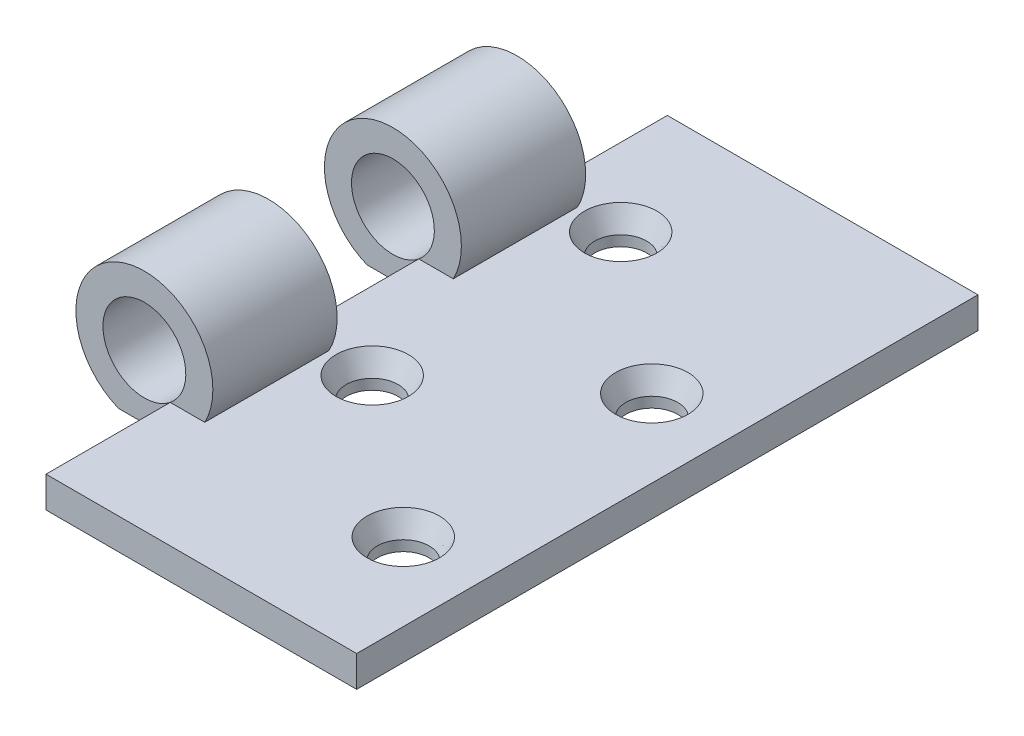
ISO-10303-21;
HEADER;
FILE_DESCRIPTION(('STEP AP214'),'2;1');
FILE_NAME('part.step','',(''),(''),'','','');
FILE_SCHEMA(('AUTOMOTIVE_DESIGN { 1 0 10303 214 1 1 1 1 }'));
ENDSEC;
DATA;
#1=APPLICATION_CONTEXT('core data for automotive mechanical design processes');
#2=APPLICATION_PROTOCOL_DEFINITION('international standard','automotive_design',2000,#1);
#3=PRODUCT_CONTEXT('',#1,'mechanical');
#4=PRODUCT('Part','Part','',(#3));
#5=PRODUCT_RELATED_PRODUCT_CATEGORY('part','',(#4));
#6=PRODUCT_DEFINITION_FORMATION('','',#4);
#7=PRODUCT_DEFINITION_CONTEXT('part definition',#1,'design');
#8=PRODUCT_DEFINITION('design','',#6,#7);
#9=PRODUCT_DEFINITION_SHAPE('','',#8);
#10=(LENGTH_UNIT() NAMED_UNIT(*) SI_UNIT(.MILLI.,.METRE.));
#11=(NAMED_UNIT(*) PLANE_ANGLE_UNIT() SI_UNIT($,.RADIAN.));
#12=(NAMED_UNIT(*) SI_UNIT($,.STERADIAN.) SOLID_ANGLE_UNIT());
#13=UNCERTAINTY_MEASURE_WITH_UNIT(LENGTH_MEASURE(1.E-05),#10,'distance_accuracy_value','');
#14=(GEOMETRIC_REPRESENTATION_CONTEXT(3) GLOBAL_UNCERTAINTY_ASSIGNED_CONTEXT((#13)) GLOBAL_UNIT_ASSIGNED_CONTEXT((#10,
#11,#12)) REPRESENTATION_CONTEXT('',''));
#15=CARTESIAN_POINT('',(0.,0.,0.));
#16=DIRECTION('',(0.,0.,1.));
#17=DIRECTION('',(1.,0.,0.));
#18=AXIS2_PLACEMENT_3D('',#15,#16,#17);
#19=CARTESIAN_POINT('',(-15.,3.,30.));
#20=DIRECTION('',(1.,0.,0.));
#21=DIRECTION('',(0.,0.,-1.));
#22=AXIS2_PLACEMENT_3D('',#19,#20,#21);
#23=PLANE('',#22);
#24=DIRECTION('',(0.,1.,0.));
#25=VECTOR('',#24,1.);
#26=CARTESIAN_POINT('',(-15.,3.,-6.));
#27=LINE('',#26,#25);
#28=CARTESIAN_POINT('',(-15.,0.,-6.));
#29=VERTEX_POINT('',#28);
#30=CARTESIAN_POINT('',(-15.,3.,-6.));
#31=VERTEX_POINT('',#30);
#32=EDGE_CURVE('E150',#29,#31,#27,.T.);
#33=ORIENTED_EDGE('',*,*,#32,.F.);
#34=DIRECTION('',(0.,0.,1.));
#35=VECTOR('',#34,1.);
#36=CARTESIAN_POINT('',(-15.,0.,30.));
#37=LINE('',#36,#35);
#38=CARTESIAN_POINT('',(-15.,0.,6.));
#39=VERTEX_POINT('',#38);
#40=EDGE_CURVE('E131',#29,#39,#37,.T.);
#41=ORIENTED_EDGE('',*,*,#40,.T.);
#42=DIRECTION('',(0.,-1.,0.));
#43=VECTOR('',#42,1.);
#44=CARTESIAN_POINT('',(-15.,3.,6.));
#45=LINE('',#44,#43);
#46=CARTESIAN_POINT('',(-15.,3.,6.));
#47=VERTEX_POINT('',#46);
#48=EDGE_CURVE('E202',#47,#39,#45,.T.);
#49=ORIENTED_EDGE('',*,*,#48,.F.);
#50=DIRECTION('',(0.,0.,1.));
#51=VECTOR('',#50,1.);
#52=CARTESIAN_POINT('',(-15.,3.,30.));
#53=LINE('',#52,#51);
#54=EDGE_CURVE('E151',#31,#47,#53,.T.);
#55=ORIENTED_EDGE('',*,*,#54,.F.);
#56=EDGE_LOOP('',(#33,#41,#49,#55));
#57=FACE_BOUND('',#56,.T.);
#58=ADVANCED_FACE('F42',(#57),#23,.F.);
#59=CARTESIAN_POINT('',(0.,3.,0.));
#60=DIRECTION('',(0.,1.,0.));
#61=DIRECTION('',(0.,0.,1.));
#62=AXIS2_PLACEMENT_3D('',#59,#60,#61);
#63=PLANE('',#62);
#64=CARTESIAN_POINT('',(-7.5,3.,6.00000000000001));
#65=DIRECTION('',(0.,1.,0.));
#66=DIRECTION('',(0.,0.,1.));
#67=AXIS2_PLACEMENT_3D('',#64,#65,#66);
#68=CIRCLE('',#67,3.5);
#69=CARTESIAN_POINT('',(-7.5,3.,9.5));
#70=VERTEX_POINT('',#69);
#71=EDGE_CURVE('E246',#70,#70,#68,.F.);
#72=ORIENTED_EDGE('',*,*,#71,.T.);
#73=EDGE_LOOP('',(#72));
#74=FACE_BOUND('',#73,.T.);
#75=CARTESIAN_POINT('',(-7.5,3.,-18.));
#76=DIRECTION('',(0.,1.,0.));
#77=DIRECTION('',(0.,0.,1.));
#78=AXIS2_PLACEMENT_3D('',#75,#76,#77);
#79=CIRCLE('',#78,3.50000000000001);
#80=CARTESIAN_POINT('',(-7.5,3.,-14.5));
#81=VERTEX_POINT('',#80);
#82=EDGE_CURVE('E243',#81,#81,#79,.F.);
#83=ORIENTED_EDGE('',*,*,#82,.T.);
#84=EDGE_LOOP('',(#83));
#85=FACE_BOUND('',#84,.T.);
#86=CARTESIAN_POINT('',(7.5,3.,-6.));
#87=DIRECTION('',(0.,1.,0.));
#88=DIRECTION('',(0.,0.,1.));
#89=AXIS2_PLACEMENT_3D('',#86,#87,#88);
#90=CIRCLE('',#89,3.50000000000001);
#91=CARTESIAN_POINT('',(7.5,3.,-2.49999999999998));
#92=VERTEX_POINT('',#91);
#93=EDGE_CURVE('E240',#92,#92,#90,.F.);
#94=ORIENTED_EDGE('',*,*,#93,.T.);
#95=EDGE_LOOP('',(#94));
#96=FACE_BOUND('',#95,.T.);
#97=CARTESIAN_POINT('',(7.5,3.,18.));
#98=DIRECTION('',(0.,1.,0.));
#99=DIRECTION('',(0.,0.,1.));
#100=AXIS2_PLACEMENT_3D('',#97,#98,#99);
#101=CIRCLE('',#100,3.50000000000001);
#102=CARTESIAN_POINT('',(7.5,3.,21.5));
#103=VERTEX_POINT('',#102);
#104=EDGE_CURVE('E237',#103,#103,#101,.F.);
#105=ORIENTED_EDGE('',*,*,#104,.T.);
#106=EDGE_LOOP('',(#105));
#107=FACE_BOUND('',#106,.T.);
#108=DIRECTION('',(0.,0.,-1.));
#109=VECTOR('',#108,1.);
#110=CARTESIAN_POINT('',(-11.6703350014606,3.,-6.));
#111=LINE('',#110,#109);
#112=CARTESIAN_POINT('',(-11.6703350014606,3.,-18.));
#113=VERTEX_POINT('',#112);
#114=CARTESIAN_POINT('',(-11.6703350014606,3.,-6.));
#115=VERTEX_POINT('',#114);
#116=EDGE_CURVE('E58',#113,#115,#111,.F.);
#117=ORIENTED_EDGE('',*,*,#116,.T.);
#118=DIRECTION('',(-1.,0.,0.));
#119=VECTOR('',#118,1.);
#120=CARTESIAN_POINT('',(0.,3.,-6.));
#121=LINE('',#120,#119);
#122=EDGE_CURVE('E156',#115,#31,#121,.T.);
#123=ORIENTED_EDGE('',*,*,#122,.T.);
#124=ORIENTED_EDGE('',*,*,#54,.T.);
#125=DIRECTION('',(1.,0.,0.));
#126=VECTOR('',#125,1.);
#127=CARTESIAN_POINT('',(0.,3.,6.));
#128=LINE('',#127,#126);
#129=CARTESIAN_POINT('',(-11.6703350014606,3.,6.));
#130=VERTEX_POINT('',#129);
#131=EDGE_CURVE('E200',#47,#130,#128,.T.);
#132=ORIENTED_EDGE('',*,*,#131,.T.);
#133=DIRECTION('',(0.,0.,1.));
#134=VECTOR('',#133,1.);
#135=CARTESIAN_POINT('',(-11.6703350014606,3.,6.));
#136=LINE('',#135,#134);
#137=CARTESIAN_POINT('',(-11.6703350014606,3.,18.));
#138=VERTEX_POINT('',#137);
#139=EDGE_CURVE('E204',#138,#130,#136,.F.);
#140=ORIENTED_EDGE('',*,*,#139,.F.);
#141=DIRECTION('',(1.,0.,0.));
#142=VECTOR('',#141,1.);
#143=CARTESIAN_POINT('',(0.,3.,18.));
#144=LINE('',#143,#142);
#145=CARTESIAN_POINT('',(-15.,3.,18.));
#146=VERTEX_POINT('',#145);
#147=EDGE_CURVE('E194',#146,#138,#144,.T.);
#148=ORIENTED_EDGE('',*,*,#147,.F.);
#149=CARTESIAN_POINT('',(-15.,3.,30.));
#150=VERTEX_POINT('',#149);
#151=EDGE_CURVE('E210',#146,#150,#53,.T.);
#152=ORIENTED_EDGE('',*,*,#151,.T.);
#153=DIRECTION('',(1.,0.,0.));
#154=VECTOR('',#153,1.);
#155=CARTESIAN_POINT('',(15.,3.,30.));
#156=LINE('',#155,#154);
#157=CARTESIAN_POINT('',(15.,3.,30.));
#158=VERTEX_POINT('',#157);
#159=EDGE_CURVE('E209',#150,#158,#156,.T.);
#160=ORIENTED_EDGE('',*,*,#159,.T.);
#161=DIRECTION('',(0.,0.,-1.));
#162=VECTOR('',#161,1.);
#163=CARTESIAN_POINT('',(15.,3.,30.));
#164=LINE('',#163,#162);
#165=CARTESIAN_POINT('',(15.,3.,-30.));
#166=VERTEX_POINT('',#165);
#167=EDGE_CURVE('E212',#158,#166,#164,.T.);
#168=ORIENTED_EDGE('',*,*,#167,.T.);
#169=DIRECTION('',(-1.,0.,0.));
#170=VECTOR('',#169,1.);
#171=CARTESIAN_POINT('',(15.,3.,-30.));
#172=LINE('',#171,#170);
#173=CARTESIAN_POINT('',(-15.,3.,-30.));
#174=VERTEX_POINT('',#173);
#175=EDGE_CURVE('E214',#166,#174,#172,.T.);
#176=ORIENTED_EDGE('',*,*,#175,.T.);
#177=CARTESIAN_POINT('',(-15.,3.,-18.));
#178=VERTEX_POINT('',#177);
#179=EDGE_CURVE('E207',#174,#178,#53,.T.);
#180=ORIENTED_EDGE('',*,*,#179,.T.);
#181=DIRECTION('',(-1.,0.,0.));
#182=VECTOR('',#181,1.);
#183=CARTESIAN_POINT('',(0.,3.,-18.));
#184=LINE('',#183,#182);
#185=EDGE_CURVE('E63',#113,#178,#184,.T.);
#186=ORIENTED_EDGE('',*,*,#185,.F.);
#187=EDGE_LOOP('',(#117,#123,#124,#132,#140,#148,#152,#160,#168,#176,#180,#186));
#188=FACE_BOUND('',#187,.T.);
#189=ADVANCED_FACE('F272',(#74,#85,#96,#107,#188),#63,.T.);
#190=CARTESIAN_POINT('',(-15.,0.,-30.));
#191=VERTEX_POINT('',#190);
#192=CARTESIAN_POINT('',(-15.,0.,-18.));
#193=VERTEX_POINT('',#192);
#194=EDGE_CURVE('E145',#191,#193,#37,.T.);
#195=ORIENTED_EDGE('',*,*,#194,.T.);
#196=DIRECTION('',(0.,1.,0.));
#197=VECTOR('',#196,1.);
#198=CARTESIAN_POINT('',(-15.,3.,-18.));
#199=LINE('',#198,#197);
#200=EDGE_CURVE('E175',#193,#178,#199,.T.);
#201=ORIENTED_EDGE('',*,*,#200,.T.);
#202=ORIENTED_EDGE('',*,*,#179,.F.);
#203=DIRECTION('',(0.,-1.,0.));
#204=VECTOR('',#203,1.);
#205=CARTESIAN_POINT('',(-15.,3.,-30.));
#206=LINE('',#205,#204);
#207=EDGE_CURVE('E215',#174,#191,#206,.T.);
#208=ORIENTED_EDGE('',*,*,#207,.T.);
#209=EDGE_LOOP('',(#195,#201,#202,#208));
#210=FACE_BOUND('',#209,.T.);
#211=ADVANCED_FACE('F274',(#210),#23,.F.);
#212=ORIENTED_EDGE('',*,*,#151,.F.);
#213=DIRECTION('',(0.,-1.,0.));
#214=VECTOR('',#213,1.);
#215=CARTESIAN_POINT('',(-15.,3.,18.));
#216=LINE('',#215,#214);
#217=CARTESIAN_POINT('',(-15.,0.,18.));
#218=VERTEX_POINT('',#217);
#219=EDGE_CURVE('E197',#146,#218,#216,.T.);
#220=ORIENTED_EDGE('',*,*,#219,.T.);
#221=CARTESIAN_POINT('',(-15.,0.,30.));
#222=VERTEX_POINT('',#221);
#223=EDGE_CURVE('E146',#218,#222,#37,.T.);
#224=ORIENTED_EDGE('',*,*,#223,.T.);
#225=DIRECTION('',(0.,-1.,0.));
#226=VECTOR('',#225,1.);
#227=CARTESIAN_POINT('',(-15.,3.,30.));
#228=LINE('',#227,#226);
#229=EDGE_CURVE('E231',#150,#222,#228,.T.);
#230=ORIENTED_EDGE('',*,*,#229,.F.);
#231=EDGE_LOOP('',(#212,#220,#224,#230));
#232=FACE_BOUND('',#231,.T.);
#233=ADVANCED_FACE('F275',(#232),#23,.F.);
#234=CARTESIAN_POINT('',(15.,3.,30.));
#235=DIRECTION('',(0.,0.,-1.));
#236=DIRECTION('',(-1.,0.,0.));
#237=AXIS2_PLACEMENT_3D('',#234,#235,#236);
#238=PLANE('',#237);
#239=DIRECTION('',(1.,0.,0.));
#240=VECTOR('',#239,1.);
#241=CARTESIAN_POINT('',(15.,0.,30.));
#242=LINE('',#241,#240);
#243=CARTESIAN_POINT('',(15.,0.,30.));
#244=VERTEX_POINT('',#243);
#245=EDGE_CURVE('E217',#222,#244,#242,.T.);
#246=ORIENTED_EDGE('',*,*,#245,.T.);
#247=DIRECTION('',(0.,-1.,0.));
#248=VECTOR('',#247,1.);
#249=CARTESIAN_POINT('',(15.,3.,30.));
#250=LINE('',#249,#248);
#251=EDGE_CURVE('E228',#158,#244,#250,.T.);
#252=ORIENTED_EDGE('',*,*,#251,.F.);
#253=ORIENTED_EDGE('',*,*,#159,.F.);
#254=ORIENTED_EDGE('',*,*,#229,.T.);
#255=EDGE_LOOP('',(#246,#252,#253,#254));
#256=FACE_BOUND('',#255,.T.);
#257=ADVANCED_FACE('F286',(#256),#238,.F.);
#258=CARTESIAN_POINT('',(15.,3.,30.));
#259=DIRECTION('',(-1.,0.,0.));
#260=DIRECTION('',(0.,0.,1.));
#261=AXIS2_PLACEMENT_3D('',#258,#259,#260);
#262=PLANE('',#261);
#263=DIRECTION('',(0.,0.,-1.));
#264=VECTOR('',#263,1.);
#265=CARTESIAN_POINT('',(15.,0.,30.));
#266=LINE('',#265,#264);
#267=CARTESIAN_POINT('',(15.,0.,-30.));
#268=VERTEX_POINT('',#267);
#269=EDGE_CURVE('E219',#244,#268,#266,.T.);
#270=ORIENTED_EDGE('',*,*,#269,.T.);
#271=DIRECTION('',(0.,-1.,0.));
#272=VECTOR('',#271,1.);
#273=CARTESIAN_POINT('',(15.,3.,-30.));
#274=LINE('',#273,#272);
#275=EDGE_CURVE('E225',#166,#268,#274,.T.);
#276=ORIENTED_EDGE('',*,*,#275,.F.);
#277=ORIENTED_EDGE('',*,*,#167,.F.);
#278=ORIENTED_EDGE('',*,*,#251,.T.);
#279=EDGE_LOOP('',(#270,#276,#277,#278));
#280=FACE_BOUND('',#279,.T.);
#281=ADVANCED_FACE('F291',(#280),#262,.F.);
#282=CARTESIAN_POINT('',(15.,3.,-30.));
#283=DIRECTION('',(0.,0.,1.));
#284=DIRECTION('',(1.,0.,0.));
#285=AXIS2_PLACEMENT_3D('',#282,#283,#284);
#286=PLANE('',#285);
#287=DIRECTION('',(-1.,0.,0.));
#288=VECTOR('',#287,1.);
#289=CARTESIAN_POINT('',(15.,0.,-30.));
#290=LINE('',#289,#288);
#291=EDGE_CURVE('E221',#268,#191,#290,.T.);
#292=ORIENTED_EDGE('',*,*,#291,.T.);
#293=ORIENTED_EDGE('',*,*,#207,.F.);
#294=ORIENTED_EDGE('',*,*,#175,.F.);
#295=ORIENTED_EDGE('',*,*,#275,.T.);
#296=EDGE_LOOP('',(#292,#293,#294,#295));
#297=FACE_BOUND('',#296,.T.);
#298=ADVANCED_FACE('F328',(#297),#286,.F.);
#299=CARTESIAN_POINT('',(0.,0.,0.));
#300=DIRECTION('',(0.,1.,0.));
#301=DIRECTION('',(0.,0.,1.));
#302=AXIS2_PLACEMENT_3D('',#299,#300,#301);
#303=PLANE('',#302);
#304=CARTESIAN_POINT('',(-7.5,0.,-18.));
#305=DIRECTION('',(0.,1.,0.));
#306=DIRECTION('',(0.,0.,1.));
#307=AXIS2_PLACEMENT_3D('',#304,#305,#306);
#308=CIRCLE('',#307,2.5);
#309=CARTESIAN_POINT('',(-7.5,0.,-15.5));
#310=VERTEX_POINT('',#309);
#311=EDGE_CURVE('E360',#310,#310,#308,.T.);
#312=ORIENTED_EDGE('',*,*,#311,.T.);
#313=EDGE_LOOP('',(#312));
#314=FACE_BOUND('',#313,.T.);
#315=CARTESIAN_POINT('',(-7.5,0.,6.00000000000001));
#316=DIRECTION('',(0.,1.,0.));
#317=DIRECTION('',(0.,0.,1.));
#318=AXIS2_PLACEMENT_3D('',#315,#316,#317);
#319=CIRCLE('',#318,2.5);
#320=CARTESIAN_POINT('',(-7.5,0.,8.50000000000001));
#321=VERTEX_POINT('',#320);
#322=EDGE_CURVE('E363',#321,#321,#319,.T.);
#323=ORIENTED_EDGE('',*,*,#322,.T.);
#324=EDGE_LOOP('',(#323));
#325=FACE_BOUND('',#324,.T.);
#326=CARTESIAN_POINT('',(7.5,0.,18.));
#327=DIRECTION('',(0.,1.,0.));
#328=DIRECTION('',(0.,0.,1.));
#329=AXIS2_PLACEMENT_3D('',#326,#327,#328);
#330=CIRCLE('',#329,2.5);
#331=CARTESIAN_POINT('',(7.5,0.,20.5));
#332=VERTEX_POINT('',#331);
#333=EDGE_CURVE('E357',#332,#332,#330,.T.);
#334=ORIENTED_EDGE('',*,*,#333,.T.);
#335=EDGE_LOOP('',(#334));
#336=FACE_BOUND('',#335,.T.);
#337=CARTESIAN_POINT('',(7.5,0.,-6.));
#338=DIRECTION('',(0.,1.,0.));
#339=DIRECTION('',(0.,0.,1.));
#340=AXIS2_PLACEMENT_3D('',#337,#338,#339);
#341=CIRCLE('',#340,2.5);
#342=CARTESIAN_POINT('',(7.5,0.,-3.5));
#343=VERTEX_POINT('',#342);
#344=EDGE_CURVE('E354',#343,#343,#341,.T.);
#345=ORIENTED_EDGE('',*,*,#344,.T.);
#346=EDGE_LOOP('',(#345));
#347=FACE_BOUND('',#346,.T.);
#348=ORIENTED_EDGE('',*,*,#194,.F.);
#349=ORIENTED_EDGE('',*,*,#291,.F.);
#350=ORIENTED_EDGE('',*,*,#269,.F.);
#351=ORIENTED_EDGE('',*,*,#245,.F.);
#352=ORIENTED_EDGE('',*,*,#223,.F.);
#353=DIRECTION('',(1.,0.,0.));
#354=VECTOR('',#353,1.);
#355=CARTESIAN_POINT('',(-15.,0.,18.));
#356=LINE('',#355,#354);
#357=CARTESIAN_POINT('',(-20.,0.,18.));
#358=VERTEX_POINT('',#357);
#359=EDGE_CURVE('E186',#358,#218,#356,.T.);
#360=ORIENTED_EDGE('',*,*,#359,.F.);
#361=DIRECTION('',(0.,0.,1.));
#362=VECTOR('',#361,1.);
#363=CARTESIAN_POINT('',(-20.,0.,6.));
#364=LINE('',#363,#362);
#365=CARTESIAN_POINT('',(-20.,0.,6.));
#366=VERTEX_POINT('',#365);
#367=EDGE_CURVE('E188',#366,#358,#364,.T.);
#368=ORIENTED_EDGE('',*,*,#367,.F.);
#369=DIRECTION('',(1.,0.,0.));
#370=VECTOR('',#369,1.);
#371=CARTESIAN_POINT('',(-15.,0.,6.));
#372=LINE('',#371,#370);
#373=EDGE_CURVE('E141',#366,#39,#372,.T.);
#374=ORIENTED_EDGE('',*,*,#373,.T.);
#375=ORIENTED_EDGE('',*,*,#40,.F.);
#376=DIRECTION('',(1.,0.,0.));
#377=VECTOR('',#376,1.);
#378=CARTESIAN_POINT('',(-15.,0.,-6.));
#379=LINE('',#378,#377);
#380=CARTESIAN_POINT('',(-20.,0.,-6.));
#381=VERTEX_POINT('',#380);
#382=EDGE_CURVE('E137',#381,#29,#379,.T.);
#383=ORIENTED_EDGE('',*,*,#382,.F.);
#384=DIRECTION('',(0.,0.,-1.));
#385=VECTOR('',#384,1.);
#386=CARTESIAN_POINT('',(-20.,0.,-6.));
#387=LINE('',#386,#385);
#388=CARTESIAN_POINT('',(-20.,0.,-18.));
#389=VERTEX_POINT('',#388);
#390=EDGE_CURVE('E161',#381,#389,#387,.T.);
#391=ORIENTED_EDGE('',*,*,#390,.T.);
#392=DIRECTION('',(1.,0.,0.));
#393=VECTOR('',#392,1.);
#394=CARTESIAN_POINT('',(-15.,0.,-18.));
#395=LINE('',#394,#393);
#396=EDGE_CURVE('E164',#389,#193,#395,.T.);
#397=ORIENTED_EDGE('',*,*,#396,.T.);
#398=EDGE_LOOP('',(#348,#349,#350,#351,#352,#360,#368,#374,#375,#383,#391,#397));
#399=FACE_BOUND('',#398,.T.);
#400=ADVANCED_FACE('F134',(#314,#325,#336,#347,#399),#303,.F.);
#401=CARTESIAN_POINT('',(-17.5,6.1224989991992,6.));
#402=DIRECTION('',(0.,0.,1.));
#403=DIRECTION('',(1.,0.,0.));
#404=AXIS2_PLACEMENT_3D('',#401,#402,#403);
#405=PLANE('',#404);
#406=CARTESIAN_POINT('',(-17.5,6.1224989991992,6.));
#407=DIRECTION('',(0.,0.,1.));
#408=DIRECTION('',(1.,0.,0.));
#409=AXIS2_PLACEMENT_3D('',#406,#407,#408);
#410=CIRCLE('',#409,4.);
#411=EDGE_CURVE('E178',#47,#47,#410,.T.);
#412=ORIENTED_EDGE('',*,*,#411,.T.);
#413=ORIENTED_EDGE('',*,*,#48,.T.);
#414=ORIENTED_EDGE('',*,*,#373,.F.);
#415=CARTESIAN_POINT('',(-17.5,6.1224989991992,6.));
#416=DIRECTION('',(0.,0.,1.));
#417=DIRECTION('',(1.,0.,0.));
#418=AXIS2_PLACEMENT_3D('',#415,#416,#417);
#419=CIRCLE('',#418,6.61324383303649);
#420=EDGE_CURVE('E184',#130,#366,#419,.T.);
#421=ORIENTED_EDGE('',*,*,#420,.F.);
#422=ORIENTED_EDGE('',*,*,#131,.F.);
#423=EDGE_LOOP('',(#412,#413,#414,#421,#422));
#424=FACE_BOUND('',#423,.T.);
#425=ADVANCED_FACE('F320',(#424),#405,.F.);
#426=CARTESIAN_POINT('',(-17.5,6.1224989991992,18.));
#427=DIRECTION('',(0.,0.,1.));
#428=DIRECTION('',(1.,0.,0.));
#429=AXIS2_PLACEMENT_3D('',#426,#427,#428);
#430=PLANE('',#429);
#431=ORIENTED_EDGE('',*,*,#219,.F.);
#432=CARTESIAN_POINT('',(-17.5,6.1224989991992,18.));
#433=DIRECTION('',(0.,0.,1.));
#434=DIRECTION('',(1.,0.,0.));
#435=AXIS2_PLACEMENT_3D('',#432,#433,#434);
#436=CIRCLE('',#435,4.);
#437=EDGE_CURVE('E155',#146,#146,#436,.T.);
#438=ORIENTED_EDGE('',*,*,#437,.F.);
#439=ORIENTED_EDGE('',*,*,#147,.T.);
#440=CARTESIAN_POINT('',(-17.5,6.1224989991992,18.));
#441=DIRECTION('',(0.,0.,1.));
#442=DIRECTION('',(1.,0.,0.));
#443=AXIS2_PLACEMENT_3D('',#440,#441,#442);
#444=CIRCLE('',#443,6.61324383303649);
#445=EDGE_CURVE('E181',#138,#358,#444,.T.);
#446=ORIENTED_EDGE('',*,*,#445,.T.);
#447=ORIENTED_EDGE('',*,*,#359,.T.);
#448=EDGE_LOOP('',(#431,#438,#439,#446,#447));
#449=FACE_BOUND('',#448,.T.);
#450=ADVANCED_FACE('F299',(#449),#430,.T.);
#451=CARTESIAN_POINT('',(-17.5,6.1224989991992,6.));
#452=DIRECTION('',(0.,0.,1.));
#453=DIRECTION('',(1.,0.,0.));
#454=AXIS2_PLACEMENT_3D('',#451,#452,#453);
#455=CYLINDRICAL_SURFACE('',#454,6.61324383303649);
#456=ORIENTED_EDGE('',*,*,#445,.F.);
#457=ORIENTED_EDGE('',*,*,#139,.T.);
#458=ORIENTED_EDGE('',*,*,#420,.T.);
#459=ORIENTED_EDGE('',*,*,#367,.T.);
#460=EDGE_LOOP('',(#456,#457,#458,#459));
#461=FACE_BOUND('',#460,.T.);
#462=ADVANCED_FACE('F304',(#461),#455,.T.);
#463=CARTESIAN_POINT('',(-17.5,6.1224989991992,6.));
#464=DIRECTION('',(0.,0.,1.));
#465=DIRECTION('',(1.,0.,0.));
#466=AXIS2_PLACEMENT_3D('',#463,#464,#465);
#467=CYLINDRICAL_SURFACE('',#466,4.);
#468=ORIENTED_EDGE('',*,*,#411,.F.);
#469=EDGE_LOOP('',(#468));
#470=FACE_BOUND('',#469,.T.);
#471=ORIENTED_EDGE('',*,*,#437,.T.);
#472=EDGE_LOOP('',(#471));
#473=FACE_BOUND('',#472,.T.);
#474=ADVANCED_FACE('F302',(#470,#473),#467,.F.);
#475=CARTESIAN_POINT('',(-17.5,6.1224989991992,-6.));
#476=DIRECTION('',(0.,0.,-1.));
#477=DIRECTION('',(1.,0.,0.));
#478=AXIS2_PLACEMENT_3D('',#475,#476,#477);
#479=PLANE('',#478);
#480=ORIENTED_EDGE('',*,*,#382,.T.);
#481=ORIENTED_EDGE('',*,*,#32,.T.);
#482=CARTESIAN_POINT('',(-17.5,6.1224989991992,-6.));
#483=DIRECTION('',(0.,0.,1.));
#484=DIRECTION('',(1.,0.,0.));
#485=AXIS2_PLACEMENT_3D('',#482,#483,#484);
#486=CIRCLE('',#485,4.);
#487=EDGE_CURVE('E170',#31,#31,#486,.T.);
#488=ORIENTED_EDGE('',*,*,#487,.F.);
#489=ORIENTED_EDGE('',*,*,#122,.F.);
#490=CARTESIAN_POINT('',(-17.5,6.1224989991992,-6.));
#491=DIRECTION('',(0.,0.,1.));
#492=DIRECTION('',(1.,0.,0.));
#493=AXIS2_PLACEMENT_3D('',#490,#491,#492);
#494=CIRCLE('',#493,6.61324383303649);
#495=EDGE_CURVE('E160',#115,#381,#494,.T.);
#496=ORIENTED_EDGE('',*,*,#495,.T.);
#497=EDGE_LOOP('',(#480,#481,#488,#489,#496));
#498=FACE_BOUND('',#497,.T.);
#499=ADVANCED_FACE('F158',(#498),#479,.F.);
#500=CARTESIAN_POINT('',(-17.5,6.1224989991992,-18.));
#501=DIRECTION('',(0.,0.,-1.));
#502=DIRECTION('',(1.,0.,0.));
#503=AXIS2_PLACEMENT_3D('',#500,#501,#502);
#504=PLANE('',#503);
#505=ORIENTED_EDGE('',*,*,#200,.F.);
#506=ORIENTED_EDGE('',*,*,#396,.F.);
#507=CARTESIAN_POINT('',(-17.5,6.1224989991992,-18.));
#508=DIRECTION('',(0.,0.,1.));
#509=DIRECTION('',(1.,0.,0.));
#510=AXIS2_PLACEMENT_3D('',#507,#508,#509);
#511=CIRCLE('',#510,6.61324383303649);
#512=EDGE_CURVE('E168',#113,#389,#511,.T.);
#513=ORIENTED_EDGE('',*,*,#512,.F.);
#514=ORIENTED_EDGE('',*,*,#185,.T.);
#515=CARTESIAN_POINT('',(-17.5,6.1224989991992,-18.));
#516=DIRECTION('',(0.,0.,1.));
#517=DIRECTION('',(1.,0.,0.));
#518=AXIS2_PLACEMENT_3D('',#515,#516,#517);
#519=CIRCLE('',#518,4.);
#520=EDGE_CURVE('E352',#178,#178,#519,.T.);
#521=ORIENTED_EDGE('',*,*,#520,.T.);
#522=EDGE_LOOP('',(#505,#506,#513,#514,#521));
#523=FACE_BOUND('',#522,.T.);
#524=ADVANCED_FACE('F311',(#523),#504,.T.);
#525=CARTESIAN_POINT('',(-17.5,6.1224989991992,-6.));
#526=DIRECTION('',(0.,0.,-1.));
#527=DIRECTION('',(-1.,0.,0.));
#528=AXIS2_PLACEMENT_3D('',#525,#526,#527);
#529=CYLINDRICAL_SURFACE('',#528,6.61324383303649);
#530=ORIENTED_EDGE('',*,*,#116,.F.);
#531=ORIENTED_EDGE('',*,*,#512,.T.);
#532=ORIENTED_EDGE('',*,*,#390,.F.);
#533=ORIENTED_EDGE('',*,*,#495,.F.);
#534=EDGE_LOOP('',(#530,#531,#532,#533));
#535=FACE_BOUND('',#534,.T.);
#536=ADVANCED_FACE('F318',(#535),#529,.T.);
#537=CARTESIAN_POINT('',(-17.5,6.1224989991992,-6.));
#538=DIRECTION('',(0.,0.,-1.));
#539=DIRECTION('',(-1.,0.,0.));
#540=AXIS2_PLACEMENT_3D('',#537,#538,#539);
#541=CYLINDRICAL_SURFACE('',#540,4.);
#542=ORIENTED_EDGE('',*,*,#487,.T.);
#543=EDGE_LOOP('',(#542));
#544=FACE_BOUND('',#543,.T.);
#545=ORIENTED_EDGE('',*,*,#520,.F.);
#546=EDGE_LOOP('',(#545));
#547=FACE_BOUND('',#546,.T.);
#548=ADVANCED_FACE('F383',(#544,#547),#541,.F.);
#549=CARTESIAN_POINT('',(7.5,0.,-6.));
#550=DIRECTION('',(0.,1.,0.));
#551=DIRECTION('',(0.,0.,1.));
#552=AXIS2_PLACEMENT_3D('',#549,#550,#551);
#553=CYLINDRICAL_SURFACE('',#552,2.5);
#554=CARTESIAN_POINT('',(7.5,0.999999999999968,-6.));
#555=DIRECTION('',(0.,1.,0.));
#556=DIRECTION('',(0.,0.,1.));
#557=AXIS2_PLACEMENT_3D('',#554,#555,#556);
#558=CIRCLE('',#557,2.5);
#559=CARTESIAN_POINT('',(7.5,0.999999999999968,-3.5));
#560=VERTEX_POINT('',#559);
#561=EDGE_CURVE('E51',#560,#560,#558,.T.);
#562=ORIENTED_EDGE('',*,*,#561,.T.);
#563=EDGE_LOOP('',(#562));
#564=FACE_BOUND('',#563,.T.);
#565=ORIENTED_EDGE('',*,*,#344,.F.);
#566=EDGE_LOOP('',(#565));
#567=FACE_BOUND('',#566,.T.);
#568=ADVANCED_FACE('F254',(#564,#567),#553,.F.);
#569=CARTESIAN_POINT('',(7.5,0.,18.));
#570=DIRECTION('',(0.,1.,0.));
#571=DIRECTION('',(0.,0.,1.));
#572=AXIS2_PLACEMENT_3D('',#569,#570,#571);
#573=CYLINDRICAL_SURFACE('',#572,2.5);
#574=CARTESIAN_POINT('',(7.5,0.999999999999958,18.));
#575=DIRECTION('',(0.,1.,0.));
#576=DIRECTION('',(0.,0.,1.));
#577=AXIS2_PLACEMENT_3D('',#574,#575,#576);
#578=CIRCLE('',#577,2.5);
#579=CARTESIAN_POINT('',(7.5,0.999999999999958,20.5));
#580=VERTEX_POINT('',#579);
#581=EDGE_CURVE('E11',#580,#580,#578,.T.);
#582=ORIENTED_EDGE('',*,*,#581,.T.);
#583=EDGE_LOOP('',(#582));
#584=FACE_BOUND('',#583,.T.);
#585=ORIENTED_EDGE('',*,*,#333,.F.);
#586=EDGE_LOOP('',(#585));
#587=FACE_BOUND('',#586,.T.);
#588=ADVANCED_FACE('F371',(#584,#587),#573,.F.);
#589=CARTESIAN_POINT('',(-7.5,0.,6.00000000000001));
#590=DIRECTION('',(0.,1.,0.));
#591=DIRECTION('',(0.,0.,1.));
#592=AXIS2_PLACEMENT_3D('',#589,#590,#591);
#593=CYLINDRICAL_SURFACE('',#592,2.5);
#594=CARTESIAN_POINT('',(-7.5,0.999999999999993,6.00000000000001));
#595=DIRECTION('',(0.,1.,0.));
#596=DIRECTION('',(0.,0.,1.));
#597=AXIS2_PLACEMENT_3D('',#594,#595,#596);
#598=CIRCLE('',#597,2.5);
#599=CARTESIAN_POINT('',(-7.5,0.999999999999993,8.50000000000001));
#600=VERTEX_POINT('',#599);
#601=EDGE_CURVE('E234',#600,#600,#598,.T.);
#602=ORIENTED_EDGE('',*,*,#601,.T.);
#603=EDGE_LOOP('',(#602));
#604=FACE_BOUND('',#603,.T.);
#605=ORIENTED_EDGE('',*,*,#322,.F.);
#606=EDGE_LOOP('',(#605));
#607=FACE_BOUND('',#606,.T.);
#608=ADVANCED_FACE('F373',(#604,#607),#593,.F.);
#609=CARTESIAN_POINT('',(-7.5,0.,-18.));
#610=DIRECTION('',(0.,1.,0.));
#611=DIRECTION('',(0.,0.,1.));
#612=AXIS2_PLACEMENT_3D('',#609,#610,#611);
#613=CYLINDRICAL_SURFACE('',#612,2.5);
#614=CARTESIAN_POINT('',(-7.5,0.99999999999996,-18.));
#615=DIRECTION('',(0.,1.,0.));
#616=DIRECTION('',(0.,0.,1.));
#617=AXIS2_PLACEMENT_3D('',#614,#615,#616);
#618=CIRCLE('',#617,2.5);
#619=CARTESIAN_POINT('',(-7.5,0.99999999999996,-15.5));
#620=VERTEX_POINT('',#619);
#621=EDGE_CURVE('E249',#620,#620,#618,.T.);
#622=ORIENTED_EDGE('',*,*,#621,.T.);
#623=EDGE_LOOP('',(#622));
#624=FACE_BOUND('',#623,.T.);
#625=ORIENTED_EDGE('',*,*,#311,.F.);
#626=EDGE_LOOP('',(#625));
#627=FACE_BOUND('',#626,.T.);
#628=ADVANCED_FACE('F380',(#624,#627),#613,.F.);
#629=CARTESIAN_POINT('',(-7.5,0.999999999999993,6.00000000000001));
#630=DIRECTION('',(0.,1.,0.));
#631=DIRECTION('',(0.,0.,1.));
#632=AXIS2_PLACEMENT_3D('',#629,#630,#631);
#633=CONICAL_SURFACE('',#632,2.5,0.463647609000803);
#634=ORIENTED_EDGE('',*,*,#71,.F.);
#635=EDGE_LOOP('',(#634));
#636=FACE_BOUND('',#635,.T.);
#637=ORIENTED_EDGE('',*,*,#601,.F.);
#638=EDGE_LOOP('',(#637));
#639=FACE_BOUND('',#638,.T.);
#640=ADVANCED_FACE('F266',(#636,#639),#633,.F.);
#641=CARTESIAN_POINT('',(-7.5,0.99999999999996,-18.));
#642=DIRECTION('',(0.,1.,0.));
#643=DIRECTION('',(0.,0.,1.));
#644=AXIS2_PLACEMENT_3D('',#641,#642,#643);
#645=CONICAL_SURFACE('',#644,2.5,0.463647609000802);
#646=ORIENTED_EDGE('',*,*,#82,.F.);
#647=EDGE_LOOP('',(#646));
#648=FACE_BOUND('',#647,.T.);
#649=ORIENTED_EDGE('',*,*,#621,.F.);
#650=EDGE_LOOP('',(#649));
#651=FACE_BOUND('',#650,.T.);
#652=ADVANCED_FACE('F259',(#648,#651),#645,.F.);
#653=CARTESIAN_POINT('',(7.5,0.999999999999968,-6.));
#654=DIRECTION('',(0.,1.,0.));
#655=DIRECTION('',(0.,0.,1.));
#656=AXIS2_PLACEMENT_3D('',#653,#654,#655);
#657=CONICAL_SURFACE('',#656,2.5,0.463647609000804);
#658=ORIENTED_EDGE('',*,*,#93,.F.);
#659=EDGE_LOOP('',(#658));
#660=FACE_BOUND('',#659,.T.);
#661=ORIENTED_EDGE('',*,*,#561,.F.);
#662=EDGE_LOOP('',(#661));
#663=FACE_BOUND('',#662,.T.);
#664=ADVANCED_FACE('F257',(#660,#663),#657,.F.);
#665=CARTESIAN_POINT('',(7.5,0.999999999999958,18.));
#666=DIRECTION('',(0.,1.,0.));
#667=DIRECTION('',(0.,0.,1.));
#668=AXIS2_PLACEMENT_3D('',#665,#666,#667);
#669=CONICAL_SURFACE('',#668,2.5,0.463647609000802);
#670=ORIENTED_EDGE('',*,*,#104,.F.);
#671=EDGE_LOOP('',(#670));
#672=FACE_BOUND('',#671,.T.);
#673=ORIENTED_EDGE('',*,*,#581,.F.);
#674=EDGE_LOOP('',(#673));
#675=FACE_BOUND('',#674,.T.);
#676=ADVANCED_FACE('F45',(#672,#675),#669,.F.);
#677=CLOSED_SHELL('',(#58,#189,#211,#233,#257,#281,#298,#400,#425,#450,#462,#474,#499,#524,#536,
#548,#568,#588,#608,#628,#640,#652,#664,#676));
#678=MANIFOLD_SOLID_BREP('B2',#677);
#679=ADVANCED_BREP_SHAPE_REPRESENTATION('',(#18,#678),#14);
#680=SHAPE_DEFINITION_REPRESENTATION(#9,#679);
ENDSEC;
END-ISO-10303-21;
